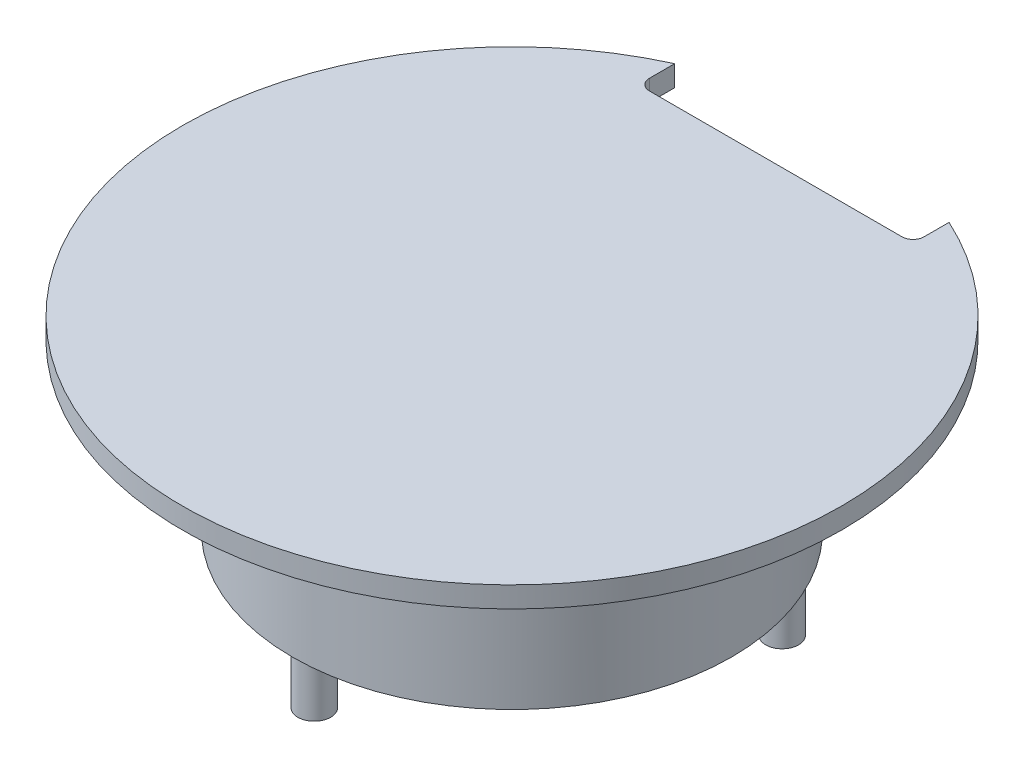
ISO-10303-21;
HEADER;
FILE_DESCRIPTION(('STEP AP214'),'2;1');
FILE_NAME('part.step','',(''),(''),'','','');
FILE_SCHEMA(('AUTOMOTIVE_DESIGN { 1 0 10303 214 1 1 1 1 }'));
ENDSEC;
DATA;
#1=APPLICATION_CONTEXT('core data for automotive mechanical design processes');
#2=APPLICATION_PROTOCOL_DEFINITION('international standard','automotive_design',2000,#1);
#3=PRODUCT_CONTEXT('',#1,'mechanical');
#4=PRODUCT('Part','Part','',(#3));
#5=PRODUCT_RELATED_PRODUCT_CATEGORY('part','',(#4));
#6=PRODUCT_DEFINITION_FORMATION('','',#4);
#7=PRODUCT_DEFINITION_CONTEXT('part definition',#1,'design');
#8=PRODUCT_DEFINITION('design','',#6,#7);
#9=PRODUCT_DEFINITION_SHAPE('','',#8);
#10=(LENGTH_UNIT() NAMED_UNIT(*) SI_UNIT(.MILLI.,.METRE.));
#11=(NAMED_UNIT(*) PLANE_ANGLE_UNIT() SI_UNIT($,.RADIAN.));
#12=(NAMED_UNIT(*) SI_UNIT($,.STERADIAN.) SOLID_ANGLE_UNIT());
#13=UNCERTAINTY_MEASURE_WITH_UNIT(LENGTH_MEASURE(1.E-05),#10,'distance_accuracy_value','');
#14=(GEOMETRIC_REPRESENTATION_CONTEXT(3) GLOBAL_UNCERTAINTY_ASSIGNED_CONTEXT((#13)) GLOBAL_UNIT_ASSIGNED_CONTEXT((#10,
#11,#12)) REPRESENTATION_CONTEXT('',''));
#15=CARTESIAN_POINT('',(0.,0.,0.));
#16=DIRECTION('',(0.,0.,1.));
#17=DIRECTION('',(1.,0.,0.));
#18=AXIS2_PLACEMENT_3D('',#15,#16,#17);
#19=CARTESIAN_POINT('',(-18.5,-3.1,0.));
#20=DIRECTION('',(0.,-1.,0.));
#21=DIRECTION('',(0.,0.,-1.));
#22=AXIS2_PLACEMENT_3D('',#19,#20,#21);
#23=PLANE('',#22);
#24=DIRECTION('',(1.,0.,0.));
#25=VECTOR('',#24,1.);
#26=CARTESIAN_POINT('',(-30.9754041082115,-3.1,-23.9789615135351));
#27=LINE('',#26,#25);
#28=CARTESIAN_POINT('',(-29.9754041082115,-3.1,-23.9789615135351));
#29=VERTEX_POINT('',#28);
#30=CARTESIAN_POINT('',(-6.97540410821149,-3.1,-23.9789615135351));
#31=VERTEX_POINT('',#30);
#32=EDGE_CURVE('E135',#29,#31,#27,.T.);
#33=ORIENTED_EDGE('',*,*,#32,.F.);
#34=CARTESIAN_POINT('',(-29.9754041082115,-3.1,-24.9789615135351));
#35=DIRECTION('',(0.,-1.,0.));
#36=DIRECTION('',(0.,0.,-1.));
#37=AXIS2_PLACEMENT_3D('',#34,#35,#36);
#38=CIRCLE('',#37,1.);
#39=CARTESIAN_POINT('',(-30.9754041082115,-3.1,-24.9789615135351));
#40=VERTEX_POINT('',#39);
#41=EDGE_CURVE('E129',#29,#40,#38,.T.);
#42=ORIENTED_EDGE('',*,*,#41,.T.);
#43=DIRECTION('',(0.,0.,-1.));
#44=VECTOR('',#43,1.);
#45=CARTESIAN_POINT('',(-30.9754041082115,-3.1,-23.9789615135351));
#46=LINE('',#45,#44);
#47=CARTESIAN_POINT('',(-30.9754041082115,-3.1,-27.2830403792689));
#48=VERTEX_POINT('',#47);
#49=EDGE_CURVE('E132',#40,#48,#46,.T.);
#50=ORIENTED_EDGE('',*,*,#49,.T.);
#51=CARTESIAN_POINT('',(-18.5,-3.1,0.));
#52=DIRECTION('',(0.,1.,0.));
#53=DIRECTION('',(0.,0.,1.));
#54=AXIS2_PLACEMENT_3D('',#51,#52,#53);
#55=CIRCLE('',#54,30.);
#56=CARTESIAN_POINT('',(-5.97540410821149,-3.1,-27.2604933511372));
#57=VERTEX_POINT('',#56);
#58=EDGE_CURVE('E206',#48,#57,#55,.T.);
#59=ORIENTED_EDGE('',*,*,#58,.T.);
#60=DIRECTION('',(0.,0.,-1.));
#61=VECTOR('',#60,1.);
#62=CARTESIAN_POINT('',(-5.97540410821149,-3.1,-23.9789615135351));
#63=LINE('',#62,#61);
#64=CARTESIAN_POINT('',(-5.97540410821149,-3.1,-24.9789615135351));
#65=VERTEX_POINT('',#64);
#66=EDGE_CURVE('E153',#65,#57,#63,.T.);
#67=ORIENTED_EDGE('',*,*,#66,.F.);
#68=CARTESIAN_POINT('',(-6.97540410821149,-3.1,-24.9789615135351));
#69=DIRECTION('',(0.,-1.,0.));
#70=DIRECTION('',(0.,0.,-1.));
#71=AXIS2_PLACEMENT_3D('',#68,#69,#70);
#72=CIRCLE('',#71,1.);
#73=EDGE_CURVE('E158',#65,#31,#72,.T.);
#74=ORIENTED_EDGE('',*,*,#73,.T.);
#75=EDGE_LOOP('',(#33,#42,#50,#59,#67,#74));
#76=FACE_BOUND('',#75,.T.);
#77=ADVANCED_FACE('F46',(#76),#23,.F.);
#78=CARTESIAN_POINT('',(-18.5,-3.1,0.));
#79=DIRECTION('',(0.,1.,0.));
#80=DIRECTION('',(0.,0.,1.));
#81=AXIS2_PLACEMENT_3D('',#78,#79,#80);
#82=CYLINDRICAL_SURFACE('',#81,30.);
#83=DIRECTION('',(0.,1.,0.));
#84=VECTOR('',#83,1.);
#85=CARTESIAN_POINT('',(-30.9754041082115,-3.1,-27.2830403792689));
#86=LINE('',#85,#84);
#87=CARTESIAN_POINT('',(-30.9754041082115,-5.,-27.2830403792689));
#88=VERTEX_POINT('',#87);
#89=EDGE_CURVE('E149',#88,#48,#86,.T.);
#90=ORIENTED_EDGE('',*,*,#89,.F.);
#91=CARTESIAN_POINT('',(-18.5,-5.,0.));
#92=DIRECTION('',(0.,1.,0.));
#93=DIRECTION('',(0.,0.,1.));
#94=AXIS2_PLACEMENT_3D('',#91,#92,#93);
#95=CIRCLE('',#94,30.);
#96=CARTESIAN_POINT('',(-5.97540410821149,-5.,-27.2604933511372));
#97=VERTEX_POINT('',#96);
#98=EDGE_CURVE('E198',#88,#97,#95,.T.);
#99=ORIENTED_EDGE('',*,*,#98,.T.);
#100=DIRECTION('',(0.,1.,0.));
#101=VECTOR('',#100,1.);
#102=CARTESIAN_POINT('',(-5.97540410821149,-3.1,-27.2604933511372));
#103=LINE('',#102,#101);
#104=EDGE_CURVE('E225',#97,#57,#103,.T.);
#105=ORIENTED_EDGE('',*,*,#104,.T.);
#106=ORIENTED_EDGE('',*,*,#58,.F.);
#107=EDGE_LOOP('',(#90,#99,#105,#106));
#108=FACE_BOUND('',#107,.T.);
#109=ADVANCED_FACE('F266',(#108),#82,.T.);
#110=CARTESIAN_POINT('',(-18.5,-5.,0.));
#111=DIRECTION('',(0.,1.,0.));
#112=DIRECTION('',(0.,0.,1.));
#113=AXIS2_PLACEMENT_3D('',#110,#111,#112);
#114=PLANE('',#113);
#115=CARTESIAN_POINT('',(-18.5,-5.,0.));
#116=DIRECTION('',(0.,1.,0.));
#117=DIRECTION('',(0.,0.,1.));
#118=AXIS2_PLACEMENT_3D('',#115,#116,#117);
#119=CIRCLE('',#118,16.);
#120=CARTESIAN_POINT('',(-27.4877020541057,-5.,-13.2371149344041));
#121=VERTEX_POINT('',#120);
#122=CARTESIAN_POINT('',(-9.48770205410575,-5.,-13.220381451926));
#123=VERTEX_POINT('',#122);
#124=EDGE_CURVE('E50',#121,#123,#119,.T.);
#125=ORIENTED_EDGE('',*,*,#124,.F.);
#126=DIRECTION('',(0.,0.,1.));
#127=VECTOR('',#126,1.);
#128=CARTESIAN_POINT('',(-27.4877020541057,-5.,-27.2830403792689));
#129=LINE('',#128,#127);
#130=CARTESIAN_POINT('',(-27.4877020541057,-5.,-17.866762767402));
#131=VERTEX_POINT('',#130);
#132=EDGE_CURVE('E190',#131,#121,#129,.T.);
#133=ORIENTED_EDGE('',*,*,#132,.F.);
#134=CARTESIAN_POINT('',(-18.5,-5.,0.));
#135=DIRECTION('',(0.,1.,0.));
#136=DIRECTION('',(0.,0.,1.));
#137=AXIS2_PLACEMENT_3D('',#134,#135,#136);
#138=CIRCLE('',#137,20.);
#139=CARTESIAN_POINT('',(-9.48770205410575,-5.,-17.8543688136666));
#140=VERTEX_POINT('',#139);
#141=EDGE_CURVE('E195',#131,#140,#138,.T.);
#142=ORIENTED_EDGE('',*,*,#141,.T.);
#143=DIRECTION('',(0.,0.,1.));
#144=VECTOR('',#143,1.);
#145=CARTESIAN_POINT('',(-9.48770205410575,-5.,-27.2830403792689));
#146=LINE('',#145,#144);
#147=EDGE_CURVE('E81',#140,#123,#146,.T.);
#148=ORIENTED_EDGE('',*,*,#147,.T.);
#149=EDGE_LOOP('',(#125,#133,#142,#148));
#150=FACE_BOUND('',#149,.T.);
#151=DIRECTION('',(1.,0.,0.));
#152=VECTOR('',#151,1.);
#153=CARTESIAN_POINT('',(1.5,-5.,-23.9789615135351));
#154=LINE('',#153,#152);
#155=CARTESIAN_POINT('',(-29.9754041082115,-5.,-23.9789615135351));
#156=VERTEX_POINT('',#155);
#157=CARTESIAN_POINT('',(-6.97540410821148,-5.,-23.9789615135351));
#158=VERTEX_POINT('',#157);
#159=EDGE_CURVE('E231',#156,#158,#154,.T.);
#160=ORIENTED_EDGE('',*,*,#159,.T.);
#161=CARTESIAN_POINT('',(-6.97540410821149,-5.,-24.9789615135351));
#162=DIRECTION('',(0.,1.,0.));
#163=DIRECTION('',(0.,0.,1.));
#164=AXIS2_PLACEMENT_3D('',#161,#162,#163);
#165=CIRCLE('',#164,1.);
#166=CARTESIAN_POINT('',(-5.97540410821149,-5.,-24.9789615135351));
#167=VERTEX_POINT('',#166);
#168=EDGE_CURVE('E142',#158,#167,#165,.T.);
#169=ORIENTED_EDGE('',*,*,#168,.T.);
#170=DIRECTION('',(0.,0.,-1.));
#171=VECTOR('',#170,1.);
#172=CARTESIAN_POINT('',(-5.97540410821149,-5.,0.));
#173=LINE('',#172,#171);
#174=EDGE_CURVE('E152',#167,#97,#173,.T.);
#175=ORIENTED_EDGE('',*,*,#174,.T.);
#176=ORIENTED_EDGE('',*,*,#98,.F.);
#177=DIRECTION('',(0.,0.,-1.));
#178=VECTOR('',#177,1.);
#179=CARTESIAN_POINT('',(-30.9754041082115,-5.,0.));
#180=LINE('',#179,#178);
#181=CARTESIAN_POINT('',(-30.9754041082115,-5.,-24.9789615135351));
#182=VERTEX_POINT('',#181);
#183=EDGE_CURVE('E246',#182,#88,#180,.T.);
#184=ORIENTED_EDGE('',*,*,#183,.F.);
#185=CARTESIAN_POINT('',(-29.9754041082115,-5.,-24.9789615135351));
#186=DIRECTION('',(0.,1.,0.));
#187=DIRECTION('',(0.,0.,1.));
#188=AXIS2_PLACEMENT_3D('',#185,#186,#187);
#189=CIRCLE('',#188,1.);
#190=EDGE_CURVE('E141',#182,#156,#189,.T.);
#191=ORIENTED_EDGE('',*,*,#190,.T.);
#192=EDGE_LOOP('',(#160,#169,#175,#176,#184,#191));
#193=FACE_BOUND('',#192,.T.);
#194=ADVANCED_FACE('F48',(#150,#193),#114,.F.);
#195=CARTESIAN_POINT('',(-18.5,-3.1,0.));
#196=DIRECTION('',(0.,1.,0.));
#197=DIRECTION('',(0.,0.,1.));
#198=AXIS2_PLACEMENT_3D('',#195,#196,#197);
#199=CYLINDRICAL_SURFACE('',#198,16.);
#200=CARTESIAN_POINT('',(-18.5,-20.,0.));
#201=DIRECTION('',(0.,1.,0.));
#202=DIRECTION('',(0.,0.,1.));
#203=AXIS2_PLACEMENT_3D('',#200,#201,#202);
#204=CIRCLE('',#203,16.);
#205=CARTESIAN_POINT('',(-18.5,-20.,16.));
#206=VERTEX_POINT('',#205);
#207=EDGE_CURVE('E203',#206,#206,#204,.T.);
#208=ORIENTED_EDGE('',*,*,#207,.F.);
#209=EDGE_LOOP('',(#208));
#210=FACE_BOUND('',#209,.T.);
#211=CARTESIAN_POINT('',(-18.5,-11.55,0.));
#212=DIRECTION('',(0.,1.,0.));
#213=DIRECTION('',(-1.,0.,0.));
#214=AXIS2_PLACEMENT_3D('',#211,#212,#213);
#215=CIRCLE('',#214,16.);
#216=CARTESIAN_POINT('',(-27.4877020541057,-11.55,-13.2371149344041));
#217=VERTEX_POINT('',#216);
#218=CARTESIAN_POINT('',(-9.48770205410575,-11.55,-13.220381451926));
#219=VERTEX_POINT('',#218);
#220=EDGE_CURVE('E274',#217,#219,#215,.F.);
#221=ORIENTED_EDGE('',*,*,#220,.F.);
#222=DIRECTION('',(0.,1.,0.));
#223=VECTOR('',#222,1.);
#224=CARTESIAN_POINT('',(-27.4877020541057,-3.1,-13.2371149344041));
#225=LINE('',#224,#223);
#226=EDGE_CURVE('E187',#217,#121,#225,.T.);
#227=ORIENTED_EDGE('',*,*,#226,.T.);
#228=ORIENTED_EDGE('',*,*,#124,.T.);
#229=DIRECTION('',(0.,1.,0.));
#230=VECTOR('',#229,1.);
#231=CARTESIAN_POINT('',(-9.48770205410575,-3.1,-13.220381451926));
#232=LINE('',#231,#230);
#233=EDGE_CURVE('E189',#123,#219,#232,.F.);
#234=ORIENTED_EDGE('',*,*,#233,.T.);
#235=EDGE_LOOP('',(#221,#227,#228,#234));
#236=FACE_BOUND('',#235,.T.);
#237=ADVANCED_FACE('F290',(#210,#236),#199,.F.);
#238=CARTESIAN_POINT('',(-2.5,-20.,0.));
#239=DIRECTION('',(0.,1.,0.));
#240=DIRECTION('',(0.,0.,1.));
#241=AXIS2_PLACEMENT_3D('',#238,#239,#240);
#242=PLANE('',#241);
#243=CARTESIAN_POINT('',(-2.91154273188019,-20.,-8.99999999999971));
#244=DIRECTION('',(0.,1.,0.));
#245=DIRECTION('',(0.,0.,1.));
#246=AXIS2_PLACEMENT_3D('',#243,#244,#245);
#247=CIRCLE('',#246,1.50000000000006);
#248=CARTESIAN_POINT('',(-2.91154273188019,-20.,-7.49999999999965));
#249=VERTEX_POINT('',#248);
#250=EDGE_CURVE('E221',#249,#249,#247,.F.);
#251=ORIENTED_EDGE('',*,*,#250,.F.);
#252=EDGE_LOOP('',(#251));
#253=FACE_BOUND('',#252,.T.);
#254=CARTESIAN_POINT('',(-34.0884572681196,-20.,-9.00000000000006));
#255=DIRECTION('',(0.,1.,0.));
#256=DIRECTION('',(0.,0.,1.));
#257=AXIS2_PLACEMENT_3D('',#254,#255,#256);
#258=CIRCLE('',#257,1.50000000000001);
#259=CARTESIAN_POINT('',(-34.0884572681196,-20.,-7.50000000000006));
#260=VERTEX_POINT('',#259);
#261=EDGE_CURVE('E217',#260,#260,#258,.F.);
#262=ORIENTED_EDGE('',*,*,#261,.F.);
#263=EDGE_LOOP('',(#262));
#264=FACE_BOUND('',#263,.T.);
#265=CARTESIAN_POINT('',(-18.5,-20.,18.));
#266=DIRECTION('',(0.,1.,0.));
#267=DIRECTION('',(0.,0.,1.));
#268=AXIS2_PLACEMENT_3D('',#265,#266,#267);
#269=CIRCLE('',#268,1.5);
#270=CARTESIAN_POINT('',(-18.5,-20.,19.5));
#271=VERTEX_POINT('',#270);
#272=EDGE_CURVE('E213',#271,#271,#269,.F.);
#273=ORIENTED_EDGE('',*,*,#272,.F.);
#274=EDGE_LOOP('',(#273));
#275=FACE_BOUND('',#274,.T.);
#276=CARTESIAN_POINT('',(-18.5,-20.,0.));
#277=DIRECTION('',(0.,1.,0.));
#278=DIRECTION('',(0.,0.,1.));
#279=AXIS2_PLACEMENT_3D('',#276,#277,#278);
#280=CIRCLE('',#279,20.);
#281=CARTESIAN_POINT('',(-18.5,-20.,20.));
#282=VERTEX_POINT('',#281);
#283=EDGE_CURVE('E197',#282,#282,#280,.T.);
#284=ORIENTED_EDGE('',*,*,#283,.F.);
#285=EDGE_LOOP('',(#284));
#286=FACE_BOUND('',#285,.T.);
#287=ORIENTED_EDGE('',*,*,#207,.T.);
#288=EDGE_LOOP('',(#287));
#289=FACE_BOUND('',#288,.T.);
#290=ADVANCED_FACE('F295',(#253,#264,#275,#286,#289),#242,.F.);
#291=CARTESIAN_POINT('',(-18.5,-3.1,0.));
#292=DIRECTION('',(0.,1.,0.));
#293=DIRECTION('',(0.,0.,1.));
#294=AXIS2_PLACEMENT_3D('',#291,#292,#293);
#295=CYLINDRICAL_SURFACE('',#294,20.);
#296=ORIENTED_EDGE('',*,*,#141,.F.);
#297=DIRECTION('',(0.,1.,0.));
#298=VECTOR('',#297,1.);
#299=CARTESIAN_POINT('',(-27.4877020541057,-3.1,-17.866762767402));
#300=LINE('',#299,#298);
#301=CARTESIAN_POINT('',(-27.4877020541057,-11.55,-17.866762767402));
#302=VERTEX_POINT('',#301);
#303=EDGE_CURVE('E12',#131,#302,#300,.F.);
#304=ORIENTED_EDGE('',*,*,#303,.T.);
#305=CARTESIAN_POINT('',(-18.5,-11.55,0.));
#306=DIRECTION('',(0.,1.,0.));
#307=DIRECTION('',(-1.,0.,0.));
#308=AXIS2_PLACEMENT_3D('',#305,#306,#307);
#309=CIRCLE('',#308,20.);
#310=CARTESIAN_POINT('',(-9.48770205410575,-11.55,-17.8543688136666));
#311=VERTEX_POINT('',#310);
#312=EDGE_CURVE('E56',#311,#302,#309,.T.);
#313=ORIENTED_EDGE('',*,*,#312,.F.);
#314=DIRECTION('',(0.,1.,0.));
#315=VECTOR('',#314,1.);
#316=CARTESIAN_POINT('',(-9.48770205410575,-3.1,-17.8543688136666));
#317=LINE('',#316,#315);
#318=EDGE_CURVE('E88',#311,#140,#317,.T.);
#319=ORIENTED_EDGE('',*,*,#318,.T.);
#320=EDGE_LOOP('',(#296,#304,#313,#319));
#321=FACE_BOUND('',#320,.T.);
#322=ORIENTED_EDGE('',*,*,#283,.T.);
#323=EDGE_LOOP('',(#322));
#324=FACE_BOUND('',#323,.T.);
#325=ADVANCED_FACE('F193',(#321,#324),#295,.T.);
#326=CARTESIAN_POINT('',(-18.5,-25.,18.));
#327=DIRECTION('',(0.,1.,0.));
#328=DIRECTION('',(0.,0.,1.));
#329=AXIS2_PLACEMENT_3D('',#326,#327,#328);
#330=CYLINDRICAL_SURFACE('',#329,1.5);
#331=CARTESIAN_POINT('',(-18.5,-25.,18.));
#332=DIRECTION('',(0.,-1.,0.));
#333=DIRECTION('',(0.,0.,-1.));
#334=AXIS2_PLACEMENT_3D('',#331,#332,#333);
#335=CIRCLE('',#334,1.5);
#336=CARTESIAN_POINT('',(-18.5,-25.,16.5));
#337=VERTEX_POINT('',#336);
#338=EDGE_CURVE('E248',#337,#337,#335,.T.);
#339=ORIENTED_EDGE('',*,*,#338,.F.);
#340=EDGE_LOOP('',(#339));
#341=FACE_BOUND('',#340,.T.);
#342=ORIENTED_EDGE('',*,*,#272,.T.);
#343=EDGE_LOOP('',(#342));
#344=FACE_BOUND('',#343,.T.);
#345=ADVANCED_FACE('F344',(#341,#344),#330,.T.);
#346=CARTESIAN_POINT('',(-18.5,-25.,18.));
#347=DIRECTION('',(0.,-1.,0.));
#348=DIRECTION('',(0.,0.,-1.));
#349=AXIS2_PLACEMENT_3D('',#346,#347,#348);
#350=PLANE('',#349);
#351=ORIENTED_EDGE('',*,*,#338,.T.);
#352=EDGE_LOOP('',(#351));
#353=FACE_BOUND('',#352,.T.);
#354=ADVANCED_FACE('F339',(#353),#350,.T.);
#355=CARTESIAN_POINT('',(-34.0884572681196,-25.,-9.00000000000006));
#356=DIRECTION('',(0.,1.,0.));
#357=DIRECTION('',(0.,0.,1.));
#358=AXIS2_PLACEMENT_3D('',#355,#356,#357);
#359=CYLINDRICAL_SURFACE('',#358,1.50000000000001);
#360=CARTESIAN_POINT('',(-34.0884572681196,-25.,-9.00000000000006));
#361=DIRECTION('',(0.,-1.,0.));
#362=DIRECTION('',(0.,0.,-1.));
#363=AXIS2_PLACEMENT_3D('',#360,#361,#362);
#364=CIRCLE('',#363,1.50000000000001);
#365=CARTESIAN_POINT('',(-34.0884572681196,-25.,-10.5000000000001));
#366=VERTEX_POINT('',#365);
#367=EDGE_CURVE('E253',#366,#366,#364,.T.);
#368=ORIENTED_EDGE('',*,*,#367,.F.);
#369=EDGE_LOOP('',(#368));
#370=FACE_BOUND('',#369,.T.);
#371=ORIENTED_EDGE('',*,*,#261,.T.);
#372=EDGE_LOOP('',(#371));
#373=FACE_BOUND('',#372,.T.);
#374=ADVANCED_FACE('F336',(#370,#373),#359,.T.);
#375=CARTESIAN_POINT('',(-34.0884572681196,-25.,-9.00000000000006));
#376=DIRECTION('',(0.,-1.,0.));
#377=DIRECTION('',(0.,0.,-1.));
#378=AXIS2_PLACEMENT_3D('',#375,#376,#377);
#379=PLANE('',#378);
#380=ORIENTED_EDGE('',*,*,#367,.T.);
#381=EDGE_LOOP('',(#380));
#382=FACE_BOUND('',#381,.T.);
#383=ADVANCED_FACE('F334',(#382),#379,.T.);
#384=CARTESIAN_POINT('',(-2.91154273188019,-25.,-8.99999999999971));
#385=DIRECTION('',(0.,1.,0.));
#386=DIRECTION('',(0.,0.,1.));
#387=AXIS2_PLACEMENT_3D('',#384,#385,#386);
#388=CYLINDRICAL_SURFACE('',#387,1.50000000000006);
#389=CARTESIAN_POINT('',(-2.91154273188019,-25.,-8.99999999999971));
#390=DIRECTION('',(0.,-1.,0.));
#391=DIRECTION('',(0.,0.,-1.));
#392=AXIS2_PLACEMENT_3D('',#389,#390,#391);
#393=CIRCLE('',#392,1.50000000000006);
#394=CARTESIAN_POINT('',(-2.91154273188019,-25.,-10.4999999999998));
#395=VERTEX_POINT('',#394);
#396=EDGE_CURVE('E257',#395,#395,#393,.T.);
#397=ORIENTED_EDGE('',*,*,#396,.F.);
#398=EDGE_LOOP('',(#397));
#399=FACE_BOUND('',#398,.T.);
#400=ORIENTED_EDGE('',*,*,#250,.T.);
#401=EDGE_LOOP('',(#400));
#402=FACE_BOUND('',#401,.T.);
#403=ADVANCED_FACE('F330',(#399,#402),#388,.T.);
#404=CARTESIAN_POINT('',(-2.91154273188019,-25.,-8.99999999999971));
#405=DIRECTION('',(0.,-1.,0.));
#406=DIRECTION('',(0.,0.,-1.));
#407=AXIS2_PLACEMENT_3D('',#404,#405,#406);
#408=PLANE('',#407);
#409=ORIENTED_EDGE('',*,*,#396,.T.);
#410=EDGE_LOOP('',(#409));
#411=FACE_BOUND('',#410,.T.);
#412=ADVANCED_FACE('F327',(#411),#408,.T.);
#413=CARTESIAN_POINT('',(-30.9754041082115,-8.1,-23.9789615135351));
#414=DIRECTION('',(0.,0.,1.));
#415=DIRECTION('',(1.,0.,0.));
#416=AXIS2_PLACEMENT_3D('',#413,#414,#415);
#417=PLANE('',#416);
#418=ORIENTED_EDGE('',*,*,#32,.T.);
#419=DIRECTION('',(0.,1.,0.));
#420=VECTOR('',#419,1.);
#421=CARTESIAN_POINT('',(-6.97540410821149,-5.,-23.9789615135351));
#422=LINE('',#421,#420);
#423=EDGE_CURVE('E159',#31,#158,#422,.F.);
#424=ORIENTED_EDGE('',*,*,#423,.T.);
#425=ORIENTED_EDGE('',*,*,#159,.F.);
#426=DIRECTION('',(0.,1.,0.));
#427=VECTOR('',#426,1.);
#428=CARTESIAN_POINT('',(-29.9754041082115,-8.1,-23.9789615135351));
#429=LINE('',#428,#427);
#430=EDGE_CURVE('E165',#156,#29,#429,.T.);
#431=ORIENTED_EDGE('',*,*,#430,.T.);
#432=EDGE_LOOP('',(#418,#424,#425,#431));
#433=FACE_BOUND('',#432,.T.);
#434=ADVANCED_FACE('F240',(#433),#417,.F.);
#435=CARTESIAN_POINT('',(-30.9754041082115,-8.1,-23.9789615135351));
#436=DIRECTION('',(1.,0.,0.));
#437=DIRECTION('',(0.,0.,-1.));
#438=AXIS2_PLACEMENT_3D('',#435,#436,#437);
#439=PLANE('',#438);
#440=ORIENTED_EDGE('',*,*,#49,.F.);
#441=DIRECTION('',(0.,1.,0.));
#442=VECTOR('',#441,1.);
#443=CARTESIAN_POINT('',(-30.9754041082115,-8.1,-24.9789615135351));
#444=LINE('',#443,#442);
#445=EDGE_CURVE('E146',#40,#182,#444,.F.);
#446=ORIENTED_EDGE('',*,*,#445,.T.);
#447=ORIENTED_EDGE('',*,*,#183,.T.);
#448=ORIENTED_EDGE('',*,*,#89,.T.);
#449=EDGE_LOOP('',(#440,#446,#447,#448));
#450=FACE_BOUND('',#449,.T.);
#451=ADVANCED_FACE('F145',(#450),#439,.T.);
#452=CARTESIAN_POINT('',(-5.97540410821149,-8.1,-23.9789615135351));
#453=DIRECTION('',(1.,0.,0.));
#454=DIRECTION('',(0.,0.,-1.));
#455=AXIS2_PLACEMENT_3D('',#452,#453,#454);
#456=PLANE('',#455);
#457=ORIENTED_EDGE('',*,*,#174,.F.);
#458=DIRECTION('',(0.,1.,0.));
#459=VECTOR('',#458,1.);
#460=CARTESIAN_POINT('',(-5.97540410821149,-3.1,-24.9789615135351));
#461=LINE('',#460,#459);
#462=EDGE_CURVE('E234',#167,#65,#461,.T.);
#463=ORIENTED_EDGE('',*,*,#462,.T.);
#464=ORIENTED_EDGE('',*,*,#66,.T.);
#465=ORIENTED_EDGE('',*,*,#104,.F.);
#466=EDGE_LOOP('',(#457,#463,#464,#465));
#467=FACE_BOUND('',#466,.T.);
#468=ADVANCED_FACE('F269',(#467),#456,.F.);
#469=CARTESIAN_POINT('',(-6.97540410821149,-8.1,-24.9789615135351));
#470=DIRECTION('',(0.,-1.,0.));
#471=DIRECTION('',(0.,0.,-1.));
#472=AXIS2_PLACEMENT_3D('',#469,#470,#471);
#473=CYLINDRICAL_SURFACE('',#472,1.);
#474=ORIENTED_EDGE('',*,*,#168,.F.);
#475=ORIENTED_EDGE('',*,*,#423,.F.);
#476=ORIENTED_EDGE('',*,*,#73,.F.);
#477=ORIENTED_EDGE('',*,*,#462,.F.);
#478=EDGE_LOOP('',(#474,#475,#476,#477));
#479=FACE_BOUND('',#478,.T.);
#480=ADVANCED_FACE('F307',(#479),#473,.F.);
#481=CARTESIAN_POINT('',(-29.9754041082115,-8.1,-24.9789615135351));
#482=DIRECTION('',(0.,1.,0.));
#483=DIRECTION('',(0.,0.,1.));
#484=AXIS2_PLACEMENT_3D('',#481,#482,#483);
#485=CYLINDRICAL_SURFACE('',#484,1.);
#486=ORIENTED_EDGE('',*,*,#190,.F.);
#487=ORIENTED_EDGE('',*,*,#445,.F.);
#488=ORIENTED_EDGE('',*,*,#41,.F.);
#489=ORIENTED_EDGE('',*,*,#430,.F.);
#490=EDGE_LOOP('',(#486,#487,#488,#489));
#491=FACE_BOUND('',#490,.T.);
#492=ADVANCED_FACE('F156',(#491),#485,.F.);
#493=CARTESIAN_POINT('',(0.,-11.55,-27.2830403792689));
#494=DIRECTION('',(0.,1.,0.));
#495=DIRECTION('',(-1.,0.,0.));
#496=AXIS2_PLACEMENT_3D('',#493,#494,#495);
#497=PLANE('',#496);
#498=ORIENTED_EDGE('',*,*,#220,.T.);
#499=DIRECTION('',(0.,0.,1.));
#500=VECTOR('',#499,1.);
#501=CARTESIAN_POINT('',(-9.48770205410575,-11.55,-27.2830403792689));
#502=LINE('',#501,#500);
#503=EDGE_CURVE('E71',#311,#219,#502,.T.);
#504=ORIENTED_EDGE('',*,*,#503,.F.);
#505=ORIENTED_EDGE('',*,*,#312,.T.);
#506=DIRECTION('',(0.,0.,1.));
#507=VECTOR('',#506,1.);
#508=CARTESIAN_POINT('',(-27.4877020541057,-11.55,-27.2830403792689));
#509=LINE('',#508,#507);
#510=EDGE_CURVE('E181',#302,#217,#509,.T.);
#511=ORIENTED_EDGE('',*,*,#510,.T.);
#512=EDGE_LOOP('',(#498,#504,#505,#511));
#513=FACE_BOUND('',#512,.T.);
#514=ADVANCED_FACE('F180',(#513),#497,.T.);
#515=CARTESIAN_POINT('',(-27.4877020541057,0.,-27.2830403792689));
#516=DIRECTION('',(-1.,0.,0.));
#517=DIRECTION('',(0.,0.,1.));
#518=AXIS2_PLACEMENT_3D('',#515,#516,#517);
#519=PLANE('',#518);
#520=ORIENTED_EDGE('',*,*,#226,.F.);
#521=ORIENTED_EDGE('',*,*,#510,.F.);
#522=ORIENTED_EDGE('',*,*,#303,.F.);
#523=ORIENTED_EDGE('',*,*,#132,.T.);
#524=EDGE_LOOP('',(#520,#521,#522,#523));
#525=FACE_BOUND('',#524,.T.);
#526=ADVANCED_FACE('F185',(#525),#519,.F.);
#527=CARTESIAN_POINT('',(-9.48770205410575,0.,-27.2830403792689));
#528=DIRECTION('',(1.,0.,0.));
#529=DIRECTION('',(0.,0.,-1.));
#530=AXIS2_PLACEMENT_3D('',#527,#528,#529);
#531=PLANE('',#530);
#532=ORIENTED_EDGE('',*,*,#233,.F.);
#533=ORIENTED_EDGE('',*,*,#147,.F.);
#534=ORIENTED_EDGE('',*,*,#318,.F.);
#535=ORIENTED_EDGE('',*,*,#503,.T.);
#536=EDGE_LOOP('',(#532,#533,#534,#535));
#537=FACE_BOUND('',#536,.T.);
#538=ADVANCED_FACE('F319',(#537),#531,.F.);
#539=CLOSED_SHELL('',(#77,#109,#194,#237,#290,#325,#345,#354,#374,#383,#403,#412,#434,#451,#468,
#480,#492,#514,#526,#538));
#540=MANIFOLD_SOLID_BREP('B2',#539);
#541=ADVANCED_BREP_SHAPE_REPRESENTATION('',(#18,#540),#14);
#542=SHAPE_DEFINITION_REPRESENTATION(#9,#541);
ENDSEC;
END-ISO-10303-21;
